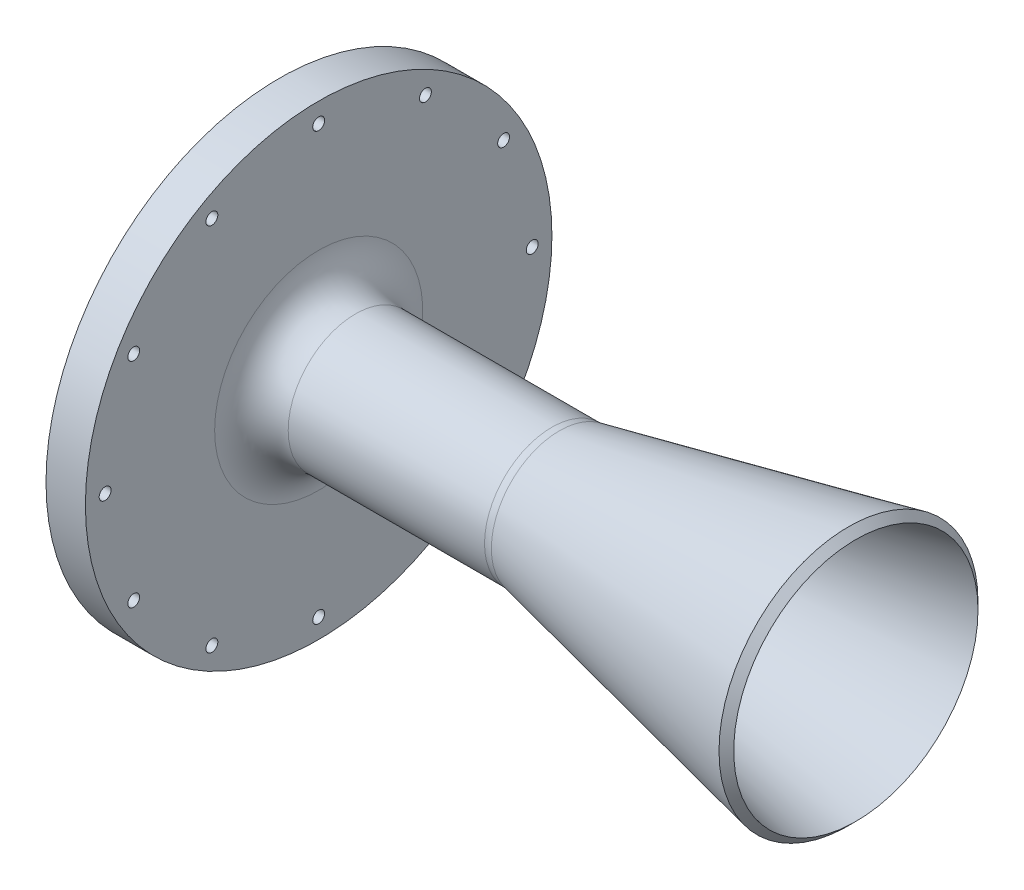
ISO-10303-21;
HEADER;
FILE_DESCRIPTION(('STEP AP214'),'2;1');
FILE_NAME('part.step','',(''),(''),'','','');
FILE_SCHEMA(('AUTOMOTIVE_DESIGN { 1 0 10303 214 1 1 1 1 }'));
ENDSEC;
DATA;
#1=APPLICATION_CONTEXT('core data for automotive mechanical design processes');
#2=APPLICATION_PROTOCOL_DEFINITION('international standard','automotive_design',2000,#1);
#3=PRODUCT_CONTEXT('',#1,'mechanical');
#4=PRODUCT('Part','Part','',(#3));
#5=PRODUCT_RELATED_PRODUCT_CATEGORY('part','',(#4));
#6=PRODUCT_DEFINITION_FORMATION('','',#4);
#7=PRODUCT_DEFINITION_CONTEXT('part definition',#1,'design');
#8=PRODUCT_DEFINITION('design','',#6,#7);
#9=PRODUCT_DEFINITION_SHAPE('','',#8);
#10=(LENGTH_UNIT() NAMED_UNIT(*) SI_UNIT(.MILLI.,.METRE.));
#11=(NAMED_UNIT(*) PLANE_ANGLE_UNIT() SI_UNIT($,.RADIAN.));
#12=(NAMED_UNIT(*) SI_UNIT($,.STERADIAN.) SOLID_ANGLE_UNIT());
#13=UNCERTAINTY_MEASURE_WITH_UNIT(LENGTH_MEASURE(1.E-05),#10,'distance_accuracy_value','');
#14=(GEOMETRIC_REPRESENTATION_CONTEXT(3) GLOBAL_UNCERTAINTY_ASSIGNED_CONTEXT((#13)) GLOBAL_UNIT_ASSIGNED_CONTEXT((#10,
#11,#12)) REPRESENTATION_CONTEXT('',''));
#15=CARTESIAN_POINT('',(0.,0.,0.));
#16=DIRECTION('',(0.,0.,1.));
#17=DIRECTION('',(1.,0.,0.));
#18=AXIS2_PLACEMENT_3D('',#15,#16,#17);
#19=CARTESIAN_POINT('',(0.,20.583496155902,0.));
#20=DIRECTION('',(1.,0.,0.));
#21=DIRECTION('',(0.,0.,-1.));
#22=AXIS2_PLACEMENT_3D('',#19,#20,#21);
#23=PLANE('',#22);
#24=CARTESIAN_POINT('',(0.,0.,0.));
#25=DIRECTION('',(1.,0.,0.));
#26=DIRECTION('',(0.,0.,-1.));
#27=AXIS2_PLACEMENT_3D('',#24,#25,#26);
#28=CIRCLE('',#27,38.1);
#29=CARTESIAN_POINT('',(0.,0.,-38.1));
#30=VERTEX_POINT('',#29);
#31=EDGE_CURVE('E171',#30,#30,#28,.T.);
#32=ORIENTED_EDGE('',*,*,#31,.T.);
#33=EDGE_LOOP('',(#32));
#34=FACE_BOUND('',#33,.T.);
#35=CARTESIAN_POINT('',(0.,-13.3616626129386,49.8664037450867));
#36=DIRECTION('',(-1.,0.,0.));
#37=DIRECTION('',(0.,0.,1.));
#38=AXIS2_PLACEMENT_3D('',#35,#36,#37);
#39=CIRCLE('',#38,2.38125);
#40=CARTESIAN_POINT('',(0.,-13.3616626129386,52.2476537450867));
#41=VERTEX_POINT('',#40);
#42=EDGE_CURVE('E59',#41,#41,#39,.T.);
#43=ORIENTED_EDGE('',*,*,#42,.F.);
#44=EDGE_LOOP('',(#43));
#45=FACE_BOUND('',#44,.T.);
#46=CARTESIAN_POINT('',(0.,13.3616626129382,-49.8664037450868));
#47=DIRECTION('',(-1.,0.,0.));
#48=DIRECTION('',(0.,0.,1.));
#49=AXIS2_PLACEMENT_3D('',#46,#47,#48);
#50=CIRCLE('',#49,2.38125);
#51=CARTESIAN_POINT('',(0.,13.3616626129382,-47.4851537450868));
#52=VERTEX_POINT('',#51);
#53=EDGE_CURVE('E58',#52,#52,#50,.T.);
#54=ORIENTED_EDGE('',*,*,#53,.F.);
#55=EDGE_LOOP('',(#54));
#56=FACE_BOUND('',#55,.T.);
#57=CARTESIAN_POINT('',(0.,-44.7089944830735,-25.81275));
#58=DIRECTION('',(-1.,0.,0.));
#59=DIRECTION('',(0.,0.,1.));
#60=AXIS2_PLACEMENT_3D('',#57,#58,#59);
#61=CIRCLE('',#60,1.43509999999999);
#62=CARTESIAN_POINT('',(0.,-44.7089944830735,-24.37765));
#63=VERTEX_POINT('',#62);
#64=EDGE_CURVE('E77',#63,#63,#61,.T.);
#65=ORIENTED_EDGE('',*,*,#64,.F.);
#66=EDGE_LOOP('',(#65));
#67=FACE_BOUND('',#66,.T.);
#68=CARTESIAN_POINT('',(0.,-25.81275,-44.7089944830735));
#69=DIRECTION('',(-1.,0.,0.));
#70=DIRECTION('',(0.,0.,1.));
#71=AXIS2_PLACEMENT_3D('',#68,#69,#70);
#72=CIRCLE('',#71,1.43509999999999);
#73=CARTESIAN_POINT('',(0.,-25.81275,-43.2738944830735));
#74=VERTEX_POINT('',#73);
#75=EDGE_CURVE('E83',#74,#74,#72,.T.);
#76=ORIENTED_EDGE('',*,*,#75,.F.);
#77=EDGE_LOOP('',(#76));
#78=FACE_BOUND('',#77,.T.);
#79=CARTESIAN_POINT('',(0.,0.,-51.6255));
#80=DIRECTION('',(-1.,0.,0.));
#81=DIRECTION('',(0.,0.,1.));
#82=AXIS2_PLACEMENT_3D('',#79,#80,#81);
#83=CIRCLE('',#82,1.43509999999999);
#84=CARTESIAN_POINT('',(0.,0.,-50.1904));
#85=VERTEX_POINT('',#84);
#86=EDGE_CURVE('E89',#85,#85,#83,.T.);
#87=ORIENTED_EDGE('',*,*,#86,.F.);
#88=EDGE_LOOP('',(#87));
#89=FACE_BOUND('',#88,.T.);
#90=CARTESIAN_POINT('',(0.,25.81275,-44.7089944830735));
#91=DIRECTION('',(-1.,0.,0.));
#92=DIRECTION('',(0.,0.,1.));
#93=AXIS2_PLACEMENT_3D('',#90,#91,#92);
#94=CIRCLE('',#93,1.43509999999999);
#95=CARTESIAN_POINT('',(0.,25.81275,-43.2738944830736));
#96=VERTEX_POINT('',#95);
#97=EDGE_CURVE('E95',#96,#96,#94,.T.);
#98=ORIENTED_EDGE('',*,*,#97,.F.);
#99=EDGE_LOOP('',(#98));
#100=FACE_BOUND('',#99,.T.);
#101=CARTESIAN_POINT('',(0.,44.7089944830735,-25.81275));
#102=DIRECTION('',(-1.,0.,0.));
#103=DIRECTION('',(0.,0.,1.));
#104=AXIS2_PLACEMENT_3D('',#101,#102,#103);
#105=CIRCLE('',#104,1.43509999999999);
#106=CARTESIAN_POINT('',(0.,44.7089944830735,-24.37765));
#107=VERTEX_POINT('',#106);
#108=EDGE_CURVE('E101',#107,#107,#105,.T.);
#109=ORIENTED_EDGE('',*,*,#108,.F.);
#110=EDGE_LOOP('',(#109));
#111=FACE_BOUND('',#110,.T.);
#112=CARTESIAN_POINT('',(0.,51.6255,0.));
#113=DIRECTION('',(-1.,0.,0.));
#114=DIRECTION('',(0.,0.,1.));
#115=AXIS2_PLACEMENT_3D('',#112,#113,#114);
#116=CIRCLE('',#115,1.43509999999999);
#117=CARTESIAN_POINT('',(0.,51.6255,1.43509999999999));
#118=VERTEX_POINT('',#117);
#119=EDGE_CURVE('E107',#118,#118,#116,.T.);
#120=ORIENTED_EDGE('',*,*,#119,.F.);
#121=EDGE_LOOP('',(#120));
#122=FACE_BOUND('',#121,.T.);
#123=CARTESIAN_POINT('',(0.,44.7089944830736,25.81275));
#124=DIRECTION('',(-1.,0.,0.));
#125=DIRECTION('',(0.,0.,1.));
#126=AXIS2_PLACEMENT_3D('',#123,#124,#125);
#127=CIRCLE('',#126,1.43509999999999);
#128=CARTESIAN_POINT('',(0.,44.7089944830736,27.24785));
#129=VERTEX_POINT('',#128);
#130=EDGE_CURVE('E113',#129,#129,#127,.T.);
#131=ORIENTED_EDGE('',*,*,#130,.F.);
#132=EDGE_LOOP('',(#131));
#133=FACE_BOUND('',#132,.T.);
#134=CARTESIAN_POINT('',(0.,25.81275,44.7089944830735));
#135=DIRECTION('',(-1.,0.,0.));
#136=DIRECTION('',(0.,0.,1.));
#137=AXIS2_PLACEMENT_3D('',#134,#135,#136);
#138=CIRCLE('',#137,1.43509999999999);
#139=CARTESIAN_POINT('',(0.,25.81275,46.1440944830735));
#140=VERTEX_POINT('',#139);
#141=EDGE_CURVE('E119',#140,#140,#138,.T.);
#142=ORIENTED_EDGE('',*,*,#141,.F.);
#143=EDGE_LOOP('',(#142));
#144=FACE_BOUND('',#143,.T.);
#145=CARTESIAN_POINT('',(0.,0.,51.6255));
#146=DIRECTION('',(-1.,0.,0.));
#147=DIRECTION('',(0.,0.,1.));
#148=AXIS2_PLACEMENT_3D('',#145,#146,#147);
#149=CIRCLE('',#148,1.43509999999999);
#150=CARTESIAN_POINT('',(0.,0.,53.0606));
#151=VERTEX_POINT('',#150);
#152=EDGE_CURVE('E125',#151,#151,#149,.T.);
#153=ORIENTED_EDGE('',*,*,#152,.F.);
#154=EDGE_LOOP('',(#153));
#155=FACE_BOUND('',#154,.T.);
#156=CARTESIAN_POINT('',(0.,-25.81275,44.7089944830736));
#157=DIRECTION('',(-1.,0.,0.));
#158=DIRECTION('',(0.,0.,1.));
#159=AXIS2_PLACEMENT_3D('',#156,#157,#158);
#160=CIRCLE('',#159,1.43509999999999);
#161=CARTESIAN_POINT('',(0.,-25.81275,46.1440944830736));
#162=VERTEX_POINT('',#161);
#163=EDGE_CURVE('E131',#162,#162,#160,.T.);
#164=ORIENTED_EDGE('',*,*,#163,.F.);
#165=EDGE_LOOP('',(#164));
#166=FACE_BOUND('',#165,.T.);
#167=CARTESIAN_POINT('',(0.,-44.7089944830735,25.81275));
#168=DIRECTION('',(-1.,0.,0.));
#169=DIRECTION('',(0.,0.,1.));
#170=AXIS2_PLACEMENT_3D('',#167,#168,#169);
#171=CIRCLE('',#170,1.43509999999999);
#172=CARTESIAN_POINT('',(0.,-44.7089944830735,27.24785));
#173=VERTEX_POINT('',#172);
#174=EDGE_CURVE('E137',#173,#173,#171,.T.);
#175=ORIENTED_EDGE('',*,*,#174,.F.);
#176=EDGE_LOOP('',(#175));
#177=FACE_BOUND('',#176,.T.);
#178=CARTESIAN_POINT('',(0.,0.,0.));
#179=DIRECTION('',(-1.,0.,0.));
#180=DIRECTION('',(0.,0.,1.));
#181=AXIS2_PLACEMENT_3D('',#178,#179,#180);
#182=CIRCLE('',#181,56.388);
#183=CARTESIAN_POINT('',(0.,0.,56.388));
#184=VERTEX_POINT('',#183);
#185=EDGE_CURVE('E146',#184,#184,#182,.T.);
#186=ORIENTED_EDGE('',*,*,#185,.T.);
#187=EDGE_LOOP('',(#186));
#188=FACE_BOUND('',#187,.T.);
#189=CARTESIAN_POINT('',(0.,-51.6255,0.));
#190=DIRECTION('',(-1.,0.,0.));
#191=DIRECTION('',(0.,0.,1.));
#192=AXIS2_PLACEMENT_3D('',#189,#190,#191);
#193=CIRCLE('',#192,1.43509999999999);
#194=CARTESIAN_POINT('',(0.,-51.6255,1.43509999999999));
#195=VERTEX_POINT('',#194);
#196=EDGE_CURVE('E71',#195,#195,#193,.T.);
#197=ORIENTED_EDGE('',*,*,#196,.F.);
#198=EDGE_LOOP('',(#197));
#199=FACE_BOUND('',#198,.T.);
#200=ADVANCED_FACE('F34',(#34,#45,#56,#67,#78,#89,#100,#111,#122,#133,#144,#155,#166,#177,#188,
#199),#23,.F.);
#201=CARTESIAN_POINT('',(60.325,0.,0.));
#202=DIRECTION('',(1.,0.,0.));
#203=DIRECTION('',(0.,0.,-1.));
#204=AXIS2_PLACEMENT_3D('',#201,#202,#203);
#205=CONICAL_SURFACE('',#204,12.7207818181818,0.20943951023932);
#206=CARTESIAN_POINT('',(139.384584692517,0.,0.));
#207=DIRECTION('',(1.,0.,0.));
#208=DIRECTION('',(0.,0.,-1.));
#209=AXIS2_PLACEMENT_3D('',#206,#207,#208);
#210=CIRCLE('',#209,29.5254153074831);
#211=CARTESIAN_POINT('',(139.384584692517,0.,-29.5254153074831));
#212=VERTEX_POINT('',#211);
#213=EDGE_CURVE('E11',#212,#212,#210,.T.);
#214=ORIENTED_EDGE('',*,*,#213,.T.);
#215=EDGE_LOOP('',(#214));
#216=FACE_BOUND('',#215,.T.);
#217=CARTESIAN_POINT('',(60.325,0.,0.));
#218=DIRECTION('',(-1.,0.,0.));
#219=DIRECTION('',(0.,0.,1.));
#220=AXIS2_PLACEMENT_3D('',#217,#218,#219);
#221=CIRCLE('',#220,12.7207818181818);
#222=CARTESIAN_POINT('',(60.325,0.,12.7207818181818));
#223=VERTEX_POINT('',#222);
#224=EDGE_CURVE('E155',#223,#223,#221,.T.);
#225=ORIENTED_EDGE('',*,*,#224,.T.);
#226=EDGE_LOOP('',(#225));
#227=FACE_BOUND('',#226,.T.);
#228=ADVANCED_FACE('F189',(#216,#227),#205,.F.);
#229=CARTESIAN_POINT('',(60.325,12.7207818181818,0.));
#230=DIRECTION('',(1.,0.,0.));
#231=DIRECTION('',(0.,0.,-1.));
#232=AXIS2_PLACEMENT_3D('',#229,#230,#231);
#233=PLANE('',#232);
#234=ORIENTED_EDGE('',*,*,#224,.F.);
#235=EDGE_LOOP('',(#234));
#236=FACE_BOUND('',#235,.T.);
#237=CARTESIAN_POINT('',(60.325,0.,0.));
#238=DIRECTION('',(-1.,0.,0.));
#239=DIRECTION('',(0.,0.,1.));
#240=AXIS2_PLACEMENT_3D('',#237,#238,#239);
#241=CIRCLE('',#240,14.351);
#242=CARTESIAN_POINT('',(60.325,0.,14.351));
#243=VERTEX_POINT('',#242);
#244=EDGE_CURVE('E152',#243,#243,#241,.T.);
#245=ORIENTED_EDGE('',*,*,#244,.T.);
#246=EDGE_LOOP('',(#245));
#247=FACE_BOUND('',#246,.T.);
#248=ADVANCED_FACE('F195',(#236,#247),#233,.F.);
#249=CARTESIAN_POINT('',(0.,0.,0.));
#250=DIRECTION('',(-1.,0.,0.));
#251=DIRECTION('',(0.,0.,1.));
#252=AXIS2_PLACEMENT_3D('',#249,#250,#251);
#253=CYLINDRICAL_SURFACE('',#252,14.351);
#254=ORIENTED_EDGE('',*,*,#244,.F.);
#255=EDGE_LOOP('',(#254));
#256=FACE_BOUND('',#255,.T.);
#257=CARTESIAN_POINT('',(10.795,0.,0.));
#258=DIRECTION('',(-1.,0.,0.));
#259=DIRECTION('',(0.,0.,1.));
#260=AXIS2_PLACEMENT_3D('',#257,#258,#259);
#261=CIRCLE('',#260,14.351);
#262=CARTESIAN_POINT('',(10.795,0.,14.351));
#263=VERTEX_POINT('',#262);
#264=EDGE_CURVE('E149',#263,#263,#261,.T.);
#265=ORIENTED_EDGE('',*,*,#264,.T.);
#266=EDGE_LOOP('',(#265));
#267=FACE_BOUND('',#266,.T.);
#268=ADVANCED_FACE('F207',(#256,#267),#253,.F.);
#269=CARTESIAN_POINT('',(0.,0.,0.));
#270=DIRECTION('',(-1.,0.,0.));
#271=DIRECTION('',(0.,0.,1.));
#272=AXIS2_PLACEMENT_3D('',#269,#270,#271);
#273=CONICAL_SURFACE('',#272,20.583496155902,0.5235987755983);
#274=CARTESIAN_POINT('',(1.61402236879913,0.,0.));
#275=DIRECTION('',(-1.,0.,0.));
#276=DIRECTION('',(0.,0.,1.));
#277=AXIS2_PLACEMENT_3D('',#274,#275,#276);
#278=CIRCLE('',#277,19.6516399067978);
#279=CARTESIAN_POINT('',(1.61402236879913,0.,19.6516399067978));
#280=VERTEX_POINT('',#279);
#281=EDGE_CURVE('E65',#280,#280,#278,.T.);
#282=ORIENTED_EDGE('',*,*,#281,.T.);
#283=EDGE_LOOP('',(#282));
#284=FACE_BOUND('',#283,.T.);
#285=ORIENTED_EDGE('',*,*,#264,.F.);
#286=EDGE_LOOP('',(#285));
#287=FACE_BOUND('',#286,.T.);
#288=ADVANCED_FACE('F204',(#284,#287),#273,.F.);
#289=CARTESIAN_POINT('',(0.,0.,0.));
#290=DIRECTION('',(-1.,0.,0.));
#291=DIRECTION('',(0.,0.,1.));
#292=AXIS2_PLACEMENT_3D('',#289,#290,#291);
#293=CYLINDRICAL_SURFACE('',#292,56.388);
#294=ORIENTED_EDGE('',*,*,#185,.F.);
#295=EDGE_LOOP('',(#294));
#296=FACE_BOUND('',#295,.T.);
#297=CARTESIAN_POINT('',(9.525,0.,0.));
#298=DIRECTION('',(-1.,0.,0.));
#299=DIRECTION('',(0.,0.,1.));
#300=AXIS2_PLACEMENT_3D('',#297,#298,#299);
#301=CIRCLE('',#300,56.388);
#302=CARTESIAN_POINT('',(9.525,0.,56.388));
#303=VERTEX_POINT('',#302);
#304=EDGE_CURVE('E143',#303,#303,#301,.T.);
#305=ORIENTED_EDGE('',*,*,#304,.T.);
#306=EDGE_LOOP('',(#305));
#307=FACE_BOUND('',#306,.T.);
#308=ADVANCED_FACE('F202',(#296,#307),#293,.T.);
#309=CARTESIAN_POINT('',(9.525,56.388,0.));
#310=DIRECTION('',(-1.,0.,0.));
#311=DIRECTION('',(0.,0.,1.));
#312=AXIS2_PLACEMENT_3D('',#309,#310,#311);
#313=PLANE('',#312);
#314=CARTESIAN_POINT('',(9.525,0.,0.));
#315=DIRECTION('',(-1.,0.,0.));
#316=DIRECTION('',(0.,0.,1.));
#317=AXIS2_PLACEMENT_3D('',#314,#315,#316);
#318=CIRCLE('',#317,25.146);
#319=CARTESIAN_POINT('',(9.525,0.,25.146));
#320=VERTEX_POINT('',#319);
#321=EDGE_CURVE('E158',#320,#320,#318,.T.);
#322=ORIENTED_EDGE('',*,*,#321,.T.);
#323=EDGE_LOOP('',(#322));
#324=FACE_BOUND('',#323,.T.);
#325=CARTESIAN_POINT('',(9.525,-51.6255,0.));
#326=DIRECTION('',(-1.,0.,0.));
#327=DIRECTION('',(0.,0.,1.));
#328=AXIS2_PLACEMENT_3D('',#325,#326,#327);
#329=CIRCLE('',#328,1.43509999999999);
#330=CARTESIAN_POINT('',(9.525,-51.6255,1.43509999999999));
#331=VERTEX_POINT('',#330);
#332=EDGE_CURVE('E74',#331,#331,#329,.T.);
#333=ORIENTED_EDGE('',*,*,#332,.T.);
#334=EDGE_LOOP('',(#333));
#335=FACE_BOUND('',#334,.T.);
#336=CARTESIAN_POINT('',(9.525,-44.7089944830735,-25.81275));
#337=DIRECTION('',(-1.,0.,0.));
#338=DIRECTION('',(0.,0.,1.));
#339=AXIS2_PLACEMENT_3D('',#336,#337,#338);
#340=CIRCLE('',#339,1.43509999999999);
#341=CARTESIAN_POINT('',(9.525,-44.7089944830735,-24.37765));
#342=VERTEX_POINT('',#341);
#343=EDGE_CURVE('E80',#342,#342,#340,.T.);
#344=ORIENTED_EDGE('',*,*,#343,.T.);
#345=EDGE_LOOP('',(#344));
#346=FACE_BOUND('',#345,.T.);
#347=CARTESIAN_POINT('',(9.525,-25.81275,-44.7089944830735));
#348=DIRECTION('',(-1.,0.,0.));
#349=DIRECTION('',(0.,0.,1.));
#350=AXIS2_PLACEMENT_3D('',#347,#348,#349);
#351=CIRCLE('',#350,1.43509999999999);
#352=CARTESIAN_POINT('',(9.525,-25.81275,-43.2738944830735));
#353=VERTEX_POINT('',#352);
#354=EDGE_CURVE('E86',#353,#353,#351,.T.);
#355=ORIENTED_EDGE('',*,*,#354,.T.);
#356=EDGE_LOOP('',(#355));
#357=FACE_BOUND('',#356,.T.);
#358=CARTESIAN_POINT('',(9.525,0.,-51.6255));
#359=DIRECTION('',(-1.,0.,0.));
#360=DIRECTION('',(0.,0.,1.));
#361=AXIS2_PLACEMENT_3D('',#358,#359,#360);
#362=CIRCLE('',#361,1.43509999999999);
#363=CARTESIAN_POINT('',(9.525,0.,-50.1904));
#364=VERTEX_POINT('',#363);
#365=EDGE_CURVE('E92',#364,#364,#362,.T.);
#366=ORIENTED_EDGE('',*,*,#365,.T.);
#367=EDGE_LOOP('',(#366));
#368=FACE_BOUND('',#367,.T.);
#369=CARTESIAN_POINT('',(9.525,25.81275,-44.7089944830735));
#370=DIRECTION('',(-1.,0.,0.));
#371=DIRECTION('',(0.,0.,1.));
#372=AXIS2_PLACEMENT_3D('',#369,#370,#371);
#373=CIRCLE('',#372,1.43509999999999);
#374=CARTESIAN_POINT('',(9.525,25.81275,-43.2738944830736));
#375=VERTEX_POINT('',#374);
#376=EDGE_CURVE('E98',#375,#375,#373,.T.);
#377=ORIENTED_EDGE('',*,*,#376,.T.);
#378=EDGE_LOOP('',(#377));
#379=FACE_BOUND('',#378,.T.);
#380=CARTESIAN_POINT('',(9.525,44.7089944830735,-25.81275));
#381=DIRECTION('',(-1.,0.,0.));
#382=DIRECTION('',(0.,0.,1.));
#383=AXIS2_PLACEMENT_3D('',#380,#381,#382);
#384=CIRCLE('',#383,1.43509999999999);
#385=CARTESIAN_POINT('',(9.525,44.7089944830735,-24.37765));
#386=VERTEX_POINT('',#385);
#387=EDGE_CURVE('E104',#386,#386,#384,.T.);
#388=ORIENTED_EDGE('',*,*,#387,.T.);
#389=EDGE_LOOP('',(#388));
#390=FACE_BOUND('',#389,.T.);
#391=CARTESIAN_POINT('',(9.525,51.6255,0.));
#392=DIRECTION('',(-1.,0.,0.));
#393=DIRECTION('',(0.,0.,1.));
#394=AXIS2_PLACEMENT_3D('',#391,#392,#393);
#395=CIRCLE('',#394,1.43509999999999);
#396=CARTESIAN_POINT('',(9.525,51.6255,1.43509999999999));
#397=VERTEX_POINT('',#396);
#398=EDGE_CURVE('E110',#397,#397,#395,.T.);
#399=ORIENTED_EDGE('',*,*,#398,.T.);
#400=EDGE_LOOP('',(#399));
#401=FACE_BOUND('',#400,.T.);
#402=CARTESIAN_POINT('',(9.525,44.7089944830736,25.81275));
#403=DIRECTION('',(-1.,0.,0.));
#404=DIRECTION('',(0.,0.,1.));
#405=AXIS2_PLACEMENT_3D('',#402,#403,#404);
#406=CIRCLE('',#405,1.43509999999999);
#407=CARTESIAN_POINT('',(9.525,44.7089944830736,27.24785));
#408=VERTEX_POINT('',#407);
#409=EDGE_CURVE('E116',#408,#408,#406,.T.);
#410=ORIENTED_EDGE('',*,*,#409,.T.);
#411=EDGE_LOOP('',(#410));
#412=FACE_BOUND('',#411,.T.);
#413=CARTESIAN_POINT('',(9.525,25.81275,44.7089944830735));
#414=DIRECTION('',(-1.,0.,0.));
#415=DIRECTION('',(0.,0.,1.));
#416=AXIS2_PLACEMENT_3D('',#413,#414,#415);
#417=CIRCLE('',#416,1.43509999999999);
#418=CARTESIAN_POINT('',(9.525,25.81275,46.1440944830735));
#419=VERTEX_POINT('',#418);
#420=EDGE_CURVE('E122',#419,#419,#417,.T.);
#421=ORIENTED_EDGE('',*,*,#420,.T.);
#422=EDGE_LOOP('',(#421));
#423=FACE_BOUND('',#422,.T.);
#424=CARTESIAN_POINT('',(9.525,0.,51.6255));
#425=DIRECTION('',(-1.,0.,0.));
#426=DIRECTION('',(0.,0.,1.));
#427=AXIS2_PLACEMENT_3D('',#424,#425,#426);
#428=CIRCLE('',#427,1.43509999999999);
#429=CARTESIAN_POINT('',(9.525,0.,53.0606));
#430=VERTEX_POINT('',#429);
#431=EDGE_CURVE('E128',#430,#430,#428,.T.);
#432=ORIENTED_EDGE('',*,*,#431,.T.);
#433=EDGE_LOOP('',(#432));
#434=FACE_BOUND('',#433,.T.);
#435=CARTESIAN_POINT('',(9.525,-25.81275,44.7089944830736));
#436=DIRECTION('',(-1.,0.,0.));
#437=DIRECTION('',(0.,0.,1.));
#438=AXIS2_PLACEMENT_3D('',#435,#436,#437);
#439=CIRCLE('',#438,1.43509999999999);
#440=CARTESIAN_POINT('',(9.525,-25.81275,46.1440944830736));
#441=VERTEX_POINT('',#440);
#442=EDGE_CURVE('E134',#441,#441,#439,.T.);
#443=ORIENTED_EDGE('',*,*,#442,.T.);
#444=EDGE_LOOP('',(#443));
#445=FACE_BOUND('',#444,.T.);
#446=CARTESIAN_POINT('',(9.525,-44.7089944830735,25.81275));
#447=DIRECTION('',(-1.,0.,0.));
#448=DIRECTION('',(0.,0.,1.));
#449=AXIS2_PLACEMENT_3D('',#446,#447,#448);
#450=CIRCLE('',#449,1.43509999999999);
#451=CARTESIAN_POINT('',(9.525,-44.7089944830735,27.24785));
#452=VERTEX_POINT('',#451);
#453=EDGE_CURVE('E140',#452,#452,#450,.T.);
#454=ORIENTED_EDGE('',*,*,#453,.T.);
#455=EDGE_LOOP('',(#454));
#456=FACE_BOUND('',#455,.T.);
#457=ORIENTED_EDGE('',*,*,#304,.F.);
#458=EDGE_LOOP('',(#457));
#459=FACE_BOUND('',#458,.T.);
#460=ADVANCED_FACE('F228',(#324,#335,#346,#357,#368,#379,#390,#401,#412,#423,#434,#445,#456,
#459),#313,.F.);
#461=CARTESIAN_POINT('',(0.,0.,0.));
#462=DIRECTION('',(-1.,0.,0.));
#463=DIRECTION('',(0.,0.,1.));
#464=AXIS2_PLACEMENT_3D('',#461,#462,#463);
#465=CYLINDRICAL_SURFACE('',#464,16.256);
#466=CARTESIAN_POINT('',(18.415,0.,0.));
#467=DIRECTION('',(-1.,0.,0.));
#468=DIRECTION('',(0.,0.,1.));
#469=AXIS2_PLACEMENT_3D('',#466,#467,#468);
#470=CIRCLE('',#469,16.256);
#471=CARTESIAN_POINT('',(18.415,0.,16.256));
#472=VERTEX_POINT('',#471);
#473=EDGE_CURVE('E164',#472,#472,#470,.F.);
#474=ORIENTED_EDGE('',*,*,#473,.T.);
#475=EDGE_LOOP('',(#474));
#476=FACE_BOUND('',#475,.T.);
#477=CARTESIAN_POINT('',(65.8720844322291,0.,0.));
#478=DIRECTION('',(-1.,0.,0.));
#479=DIRECTION('',(0.,0.,1.));
#480=AXIS2_PLACEMENT_3D('',#477,#478,#479);
#481=CIRCLE('',#480,16.256);
#482=CARTESIAN_POINT('',(65.8720844322291,0.,16.256));
#483=VERTEX_POINT('',#482);
#484=EDGE_CURVE('E161',#483,#483,#481,.T.);
#485=ORIENTED_EDGE('',*,*,#484,.T.);
#486=EDGE_LOOP('',(#485));
#487=FACE_BOUND('',#486,.T.);
#488=ADVANCED_FACE('F226',(#476,#487),#465,.T.);
#489=CARTESIAN_POINT('',(139.7,0.,0.));
#490=DIRECTION('',(1.,0.,0.));
#491=DIRECTION('',(0.,0.,-1.));
#492=AXIS2_PLACEMENT_3D('',#489,#490,#491);
#493=CONICAL_SURFACE('',#492,31.75,0.20943951023932);
#494=CARTESIAN_POINT('',(137.605252356639,0.,0.));
#495=DIRECTION('',(-1.,0.,0.));
#496=DIRECTION('',(0.,0.,1.));
#497=AXIS2_PLACEMENT_3D('',#494,#495,#496);
#498=CIRCLE('',#497,31.3047476433608);
#499=CARTESIAN_POINT('',(137.605252356639,0.,31.3047476433608));
#500=VERTEX_POINT('',#499);
#501=EDGE_CURVE('E42',#500,#500,#498,.T.);
#502=ORIENTED_EDGE('',*,*,#501,.T.);
#503=EDGE_LOOP('',(#502));
#504=FACE_BOUND('',#503,.T.);
#505=CARTESIAN_POINT('',(67.720419363599,0.,0.));
#506=DIRECTION('',(1.,0.,0.));
#507=DIRECTION('',(0.,0.,-1.));
#508=AXIS2_PLACEMENT_3D('',#505,#506,#507);
#509=CIRCLE('',#508,16.4502678294765);
#510=CARTESIAN_POINT('',(67.720419363599,0.,-16.4502678294765));
#511=VERTEX_POINT('',#510);
#512=EDGE_CURVE('E167',#511,#511,#509,.T.);
#513=ORIENTED_EDGE('',*,*,#512,.T.);
#514=EDGE_LOOP('',(#513));
#515=FACE_BOUND('',#514,.T.);
#516=ADVANCED_FACE('F175',(#504,#515),#493,.T.);
#517=CARTESIAN_POINT('',(0.,-44.7089944830735,25.81275));
#518=DIRECTION('',(-1.,0.,0.));
#519=DIRECTION('',(0.,0.,1.));
#520=AXIS2_PLACEMENT_3D('',#517,#518,#519);
#521=CYLINDRICAL_SURFACE('',#520,1.43509999999999);
#522=ORIENTED_EDGE('',*,*,#453,.F.);
#523=EDGE_LOOP('',(#522));
#524=FACE_BOUND('',#523,.T.);
#525=ORIENTED_EDGE('',*,*,#174,.T.);
#526=EDGE_LOOP('',(#525));
#527=FACE_BOUND('',#526,.T.);
#528=ADVANCED_FACE('F235',(#524,#527),#521,.F.);
#529=CARTESIAN_POINT('',(0.,-25.81275,44.7089944830736));
#530=DIRECTION('',(-1.,0.,0.));
#531=DIRECTION('',(0.,0.,1.));
#532=AXIS2_PLACEMENT_3D('',#529,#530,#531);
#533=CYLINDRICAL_SURFACE('',#532,1.43509999999999);
#534=ORIENTED_EDGE('',*,*,#442,.F.);
#535=EDGE_LOOP('',(#534));
#536=FACE_BOUND('',#535,.T.);
#537=ORIENTED_EDGE('',*,*,#163,.T.);
#538=EDGE_LOOP('',(#537));
#539=FACE_BOUND('',#538,.T.);
#540=ADVANCED_FACE('F241',(#536,#539),#533,.F.);
#541=CARTESIAN_POINT('',(0.,0.,51.6255));
#542=DIRECTION('',(-1.,0.,0.));
#543=DIRECTION('',(0.,0.,1.));
#544=AXIS2_PLACEMENT_3D('',#541,#542,#543);
#545=CYLINDRICAL_SURFACE('',#544,1.43509999999999);
#546=ORIENTED_EDGE('',*,*,#431,.F.);
#547=EDGE_LOOP('',(#546));
#548=FACE_BOUND('',#547,.T.);
#549=ORIENTED_EDGE('',*,*,#152,.T.);
#550=EDGE_LOOP('',(#549));
#551=FACE_BOUND('',#550,.T.);
#552=ADVANCED_FACE('F245',(#548,#551),#545,.F.);
#553=CARTESIAN_POINT('',(0.,25.81275,44.7089944830735));
#554=DIRECTION('',(-1.,0.,0.));
#555=DIRECTION('',(0.,0.,1.));
#556=AXIS2_PLACEMENT_3D('',#553,#554,#555);
#557=CYLINDRICAL_SURFACE('',#556,1.43509999999999);
#558=ORIENTED_EDGE('',*,*,#420,.F.);
#559=EDGE_LOOP('',(#558));
#560=FACE_BOUND('',#559,.T.);
#561=ORIENTED_EDGE('',*,*,#141,.T.);
#562=EDGE_LOOP('',(#561));
#563=FACE_BOUND('',#562,.T.);
#564=ADVANCED_FACE('F249',(#560,#563),#557,.F.);
#565=CARTESIAN_POINT('',(0.,44.7089944830736,25.81275));
#566=DIRECTION('',(-1.,0.,0.));
#567=DIRECTION('',(0.,0.,1.));
#568=AXIS2_PLACEMENT_3D('',#565,#566,#567);
#569=CYLINDRICAL_SURFACE('',#568,1.43509999999999);
#570=ORIENTED_EDGE('',*,*,#409,.F.);
#571=EDGE_LOOP('',(#570));
#572=FACE_BOUND('',#571,.T.);
#573=ORIENTED_EDGE('',*,*,#130,.T.);
#574=EDGE_LOOP('',(#573));
#575=FACE_BOUND('',#574,.T.);
#576=ADVANCED_FACE('F253',(#572,#575),#569,.F.);
#577=CARTESIAN_POINT('',(0.,51.6255,0.));
#578=DIRECTION('',(-1.,0.,0.));
#579=DIRECTION('',(0.,0.,1.));
#580=AXIS2_PLACEMENT_3D('',#577,#578,#579);
#581=CYLINDRICAL_SURFACE('',#580,1.43509999999999);
#582=ORIENTED_EDGE('',*,*,#398,.F.);
#583=EDGE_LOOP('',(#582));
#584=FACE_BOUND('',#583,.T.);
#585=ORIENTED_EDGE('',*,*,#119,.T.);
#586=EDGE_LOOP('',(#585));
#587=FACE_BOUND('',#586,.T.);
#588=ADVANCED_FACE('F257',(#584,#587),#581,.F.);
#589=CARTESIAN_POINT('',(0.,44.7089944830735,-25.81275));
#590=DIRECTION('',(-1.,0.,0.));
#591=DIRECTION('',(0.,0.,1.));
#592=AXIS2_PLACEMENT_3D('',#589,#590,#591);
#593=CYLINDRICAL_SURFACE('',#592,1.43509999999999);
#594=ORIENTED_EDGE('',*,*,#387,.F.);
#595=EDGE_LOOP('',(#594));
#596=FACE_BOUND('',#595,.T.);
#597=ORIENTED_EDGE('',*,*,#108,.T.);
#598=EDGE_LOOP('',(#597));
#599=FACE_BOUND('',#598,.T.);
#600=ADVANCED_FACE('F261',(#596,#599),#593,.F.);
#601=CARTESIAN_POINT('',(0.,25.81275,-44.7089944830735));
#602=DIRECTION('',(-1.,0.,0.));
#603=DIRECTION('',(0.,0.,1.));
#604=AXIS2_PLACEMENT_3D('',#601,#602,#603);
#605=CYLINDRICAL_SURFACE('',#604,1.43509999999999);
#606=ORIENTED_EDGE('',*,*,#376,.F.);
#607=EDGE_LOOP('',(#606));
#608=FACE_BOUND('',#607,.T.);
#609=ORIENTED_EDGE('',*,*,#97,.T.);
#610=EDGE_LOOP('',(#609));
#611=FACE_BOUND('',#610,.T.);
#612=ADVANCED_FACE('F265',(#608,#611),#605,.F.);
#613=CARTESIAN_POINT('',(0.,0.,-51.6255));
#614=DIRECTION('',(-1.,0.,0.));
#615=DIRECTION('',(0.,0.,1.));
#616=AXIS2_PLACEMENT_3D('',#613,#614,#615);
#617=CYLINDRICAL_SURFACE('',#616,1.43509999999999);
#618=ORIENTED_EDGE('',*,*,#365,.F.);
#619=EDGE_LOOP('',(#618));
#620=FACE_BOUND('',#619,.T.);
#621=ORIENTED_EDGE('',*,*,#86,.T.);
#622=EDGE_LOOP('',(#621));
#623=FACE_BOUND('',#622,.T.);
#624=ADVANCED_FACE('F269',(#620,#623),#617,.F.);
#625=CARTESIAN_POINT('',(0.,-25.81275,-44.7089944830735));
#626=DIRECTION('',(-1.,0.,0.));
#627=DIRECTION('',(0.,0.,1.));
#628=AXIS2_PLACEMENT_3D('',#625,#626,#627);
#629=CYLINDRICAL_SURFACE('',#628,1.43509999999999);
#630=ORIENTED_EDGE('',*,*,#354,.F.);
#631=EDGE_LOOP('',(#630));
#632=FACE_BOUND('',#631,.T.);
#633=ORIENTED_EDGE('',*,*,#75,.T.);
#634=EDGE_LOOP('',(#633));
#635=FACE_BOUND('',#634,.T.);
#636=ADVANCED_FACE('F273',(#632,#635),#629,.F.);
#637=CARTESIAN_POINT('',(0.,-44.7089944830735,-25.81275));
#638=DIRECTION('',(-1.,0.,0.));
#639=DIRECTION('',(0.,0.,1.));
#640=AXIS2_PLACEMENT_3D('',#637,#638,#639);
#641=CYLINDRICAL_SURFACE('',#640,1.43509999999999);
#642=ORIENTED_EDGE('',*,*,#343,.F.);
#643=EDGE_LOOP('',(#642));
#644=FACE_BOUND('',#643,.T.);
#645=ORIENTED_EDGE('',*,*,#64,.T.);
#646=EDGE_LOOP('',(#645));
#647=FACE_BOUND('',#646,.T.);
#648=ADVANCED_FACE('F277',(#644,#647),#641,.F.);
#649=CARTESIAN_POINT('',(0.,-51.6255,0.));
#650=DIRECTION('',(-1.,0.,0.));
#651=DIRECTION('',(0.,0.,1.));
#652=AXIS2_PLACEMENT_3D('',#649,#650,#651);
#653=CYLINDRICAL_SURFACE('',#652,1.43509999999999);
#654=ORIENTED_EDGE('',*,*,#332,.F.);
#655=EDGE_LOOP('',(#654));
#656=FACE_BOUND('',#655,.T.);
#657=ORIENTED_EDGE('',*,*,#196,.T.);
#658=EDGE_LOOP('',(#657));
#659=FACE_BOUND('',#658,.T.);
#660=ADVANCED_FACE('F281',(#656,#659),#653,.F.);
#661=CARTESIAN_POINT('',(6.35,13.3616626129382,-49.8664037450868));
#662=DIRECTION('',(-1.,0.,0.));
#663=DIRECTION('',(0.,0.,1.));
#664=AXIS2_PLACEMENT_3D('',#661,#662,#663);
#665=CONICAL_SURFACE('',#664,2.38124999999999,1.02974425867665);
#666=CARTESIAN_POINT('',(7.78079934905938,13.3616626129382,-49.8664037450868));
#667=VERTEX_POINT('',#666);
#668=VERTEX_LOOP('',#667);
#669=FACE_BOUND('',#668,.T.);
#670=CARTESIAN_POINT('',(6.35,13.3616626129382,-49.8664037450868));
#671=DIRECTION('',(-1.,0.,0.));
#672=DIRECTION('',(0.,0.,1.));
#673=AXIS2_PLACEMENT_3D('',#670,#671,#672);
#674=CIRCLE('',#673,2.38124999999999);
#675=CARTESIAN_POINT('',(6.35,13.3616626129382,-47.4851537450868));
#676=VERTEX_POINT('',#675);
#677=EDGE_CURVE('E62',#676,#676,#674,.T.);
#678=ORIENTED_EDGE('',*,*,#677,.T.);
#679=EDGE_LOOP('',(#678));
#680=FACE_BOUND('',#679,.T.);
#681=ADVANCED_FACE('F285',(#669,#680),#665,.F.);
#682=CARTESIAN_POINT('',(0.,13.3616626129382,-49.8664037450868));
#683=DIRECTION('',(-1.,0.,0.));
#684=DIRECTION('',(0.,0.,1.));
#685=AXIS2_PLACEMENT_3D('',#682,#683,#684);
#686=CYLINDRICAL_SURFACE('',#685,2.38125);
#687=ORIENTED_EDGE('',*,*,#677,.F.);
#688=EDGE_LOOP('',(#687));
#689=FACE_BOUND('',#688,.T.);
#690=ORIENTED_EDGE('',*,*,#53,.T.);
#691=EDGE_LOOP('',(#690));
#692=FACE_BOUND('',#691,.T.);
#693=ADVANCED_FACE('F52',(#689,#692),#686,.F.);
#694=CARTESIAN_POINT('',(6.35,-13.3616626129386,49.8664037450867));
#695=DIRECTION('',(-1.,0.,0.));
#696=DIRECTION('',(0.,0.,1.));
#697=AXIS2_PLACEMENT_3D('',#694,#695,#696);
#698=CONICAL_SURFACE('',#697,2.38125,1.02974425867665);
#699=CARTESIAN_POINT('',(7.78079934905938,-13.3616626129386,49.8664037450867));
#700=VERTEX_POINT('',#699);
#701=VERTEX_LOOP('',#700);
#702=FACE_BOUND('',#701,.T.);
#703=CARTESIAN_POINT('',(6.35,-13.3616626129386,49.8664037450867));
#704=DIRECTION('',(-1.,0.,0.));
#705=DIRECTION('',(0.,0.,1.));
#706=AXIS2_PLACEMENT_3D('',#703,#704,#705);
#707=CIRCLE('',#706,2.38125);
#708=CARTESIAN_POINT('',(6.35,-13.3616626129386,52.2476537450867));
#709=VERTEX_POINT('',#708);
#710=EDGE_CURVE('E56',#709,#709,#707,.T.);
#711=ORIENTED_EDGE('',*,*,#710,.T.);
#712=EDGE_LOOP('',(#711));
#713=FACE_BOUND('',#712,.T.);
#714=ADVANCED_FACE('F48',(#702,#713),#698,.F.);
#715=CARTESIAN_POINT('',(0.,-13.3616626129386,49.8664037450867));
#716=DIRECTION('',(-1.,0.,0.));
#717=DIRECTION('',(0.,0.,1.));
#718=AXIS2_PLACEMENT_3D('',#715,#716,#717);
#719=CYLINDRICAL_SURFACE('',#718,2.38125);
#720=ORIENTED_EDGE('',*,*,#710,.F.);
#721=EDGE_LOOP('',(#720));
#722=FACE_BOUND('',#721,.T.);
#723=ORIENTED_EDGE('',*,*,#42,.T.);
#724=EDGE_LOOP('',(#723));
#725=FACE_BOUND('',#724,.T.);
#726=ADVANCED_FACE('F51',(#722,#725),#719,.F.);
#727=CARTESIAN_POINT('',(18.415,0.,0.));
#728=DIRECTION('',(-1.,0.,0.));
#729=DIRECTION('',(0.,0.,1.));
#730=AXIS2_PLACEMENT_3D('',#727,#728,#729);
#731=TOROIDAL_SURFACE('',#730,25.146,8.89);
#732=ORIENTED_EDGE('',*,*,#473,.F.);
#733=EDGE_LOOP('',(#732));
#734=FACE_BOUND('',#733,.T.);
#735=ORIENTED_EDGE('',*,*,#321,.F.);
#736=EDGE_LOOP('',(#735));
#737=FACE_BOUND('',#736,.T.);
#738=ADVANCED_FACE('F215',(#734,#737),#731,.F.);
#739=CARTESIAN_POINT('',(65.8720844322291,0.,0.));
#740=DIRECTION('',(-1.,0.,0.));
#741=DIRECTION('',(0.,0.,1.));
#742=AXIS2_PLACEMENT_3D('',#739,#740,#741);
#743=TOROIDAL_SURFACE('',#742,25.146,8.89);
#744=ORIENTED_EDGE('',*,*,#512,.F.);
#745=EDGE_LOOP('',(#744));
#746=FACE_BOUND('',#745,.T.);
#747=ORIENTED_EDGE('',*,*,#484,.F.);
#748=EDGE_LOOP('',(#747));
#749=FACE_BOUND('',#748,.T.);
#750=ADVANCED_FACE('F184',(#746,#749),#743,.F.);
#751=CARTESIAN_POINT('',(3.33331808033745,0.,0.));
#752=DIRECTION('',(-1.,0.,0.));
#753=DIRECTION('',(0.,0.,1.));
#754=AXIS2_PLACEMENT_3D('',#751,#752,#753);
#755=CONICAL_SURFACE('',#754,0.,1.48352986419519);
#756=ORIENTED_EDGE('',*,*,#31,.F.);
#757=EDGE_LOOP('',(#756));
#758=FACE_BOUND('',#757,.T.);
#759=ORIENTED_EDGE('',*,*,#281,.F.);
#760=EDGE_LOOP('',(#759));
#761=FACE_BOUND('',#760,.T.);
#762=ADVANCED_FACE('F179',(#758,#761),#755,.F.);
#763=CARTESIAN_POINT('',(137.605252356639,0.,0.));
#764=DIRECTION('',(-1.,0.,0.));
#765=DIRECTION('',(0.,0.,1.));
#766=AXIS2_PLACEMENT_3D('',#763,#764,#765);
#767=CONICAL_SURFACE('',#766,31.3047476433608,0.78539816339744);
#768=ORIENTED_EDGE('',*,*,#213,.F.);
#769=EDGE_LOOP('',(#768));
#770=FACE_BOUND('',#769,.T.);
#771=ORIENTED_EDGE('',*,*,#501,.F.);
#772=EDGE_LOOP('',(#771));
#773=FACE_BOUND('',#772,.T.);
#774=ADVANCED_FACE('F36',(#770,#773),#767,.T.);
#775=CLOSED_SHELL('',(#200,#228,#248,#268,#288,#308,#460,#488,#516,#528,#540,#552,#564,#576,
#588,#600,#612,#624,#636,#648,#660,#681,#693,#714,#726,#738,#750,#762,#774));
#776=MANIFOLD_SOLID_BREP('B2',#775);
#777=ADVANCED_BREP_SHAPE_REPRESENTATION('',(#18,#776),#14);
#778=SHAPE_DEFINITION_REPRESENTATION(#9,#777);
ENDSEC;
END-ISO-10303-21;
